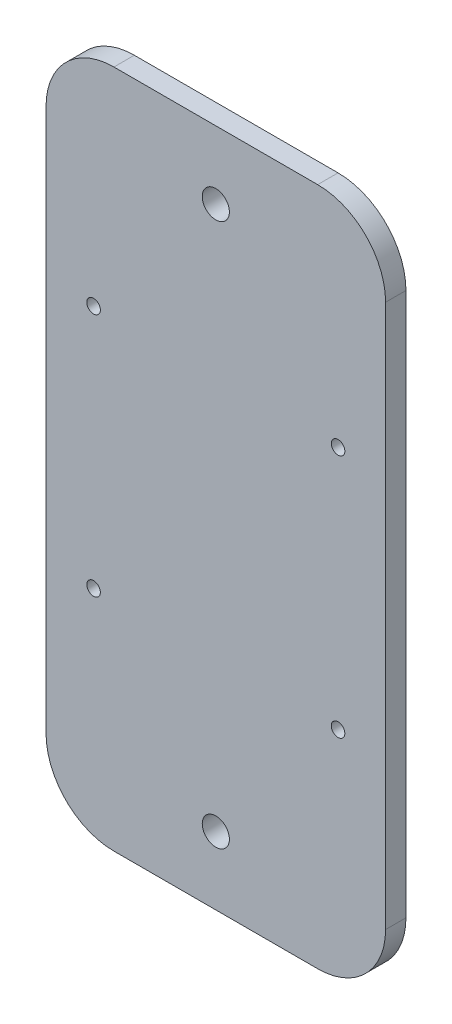
ISO-10303-21;
HEADER;
FILE_DESCRIPTION(('STEP AP214'),'2;1');
FILE_NAME('part.step','',(''),(''),'','','');
FILE_SCHEMA(('AUTOMOTIVE_DESIGN { 1 0 10303 214 1 1 1 1 }'));
ENDSEC;
DATA;
#1=APPLICATION_CONTEXT('core data for automotive mechanical design processes');
#2=APPLICATION_PROTOCOL_DEFINITION('international standard','automotive_design',2000,#1);
#3=PRODUCT_CONTEXT('',#1,'mechanical');
#4=PRODUCT('Part','Part','',(#3));
#5=PRODUCT_RELATED_PRODUCT_CATEGORY('part','',(#4));
#6=PRODUCT_DEFINITION_FORMATION('','',#4);
#7=PRODUCT_DEFINITION_CONTEXT('part definition',#1,'design');
#8=PRODUCT_DEFINITION('design','',#6,#7);
#9=PRODUCT_DEFINITION_SHAPE('','',#8);
#10=(LENGTH_UNIT() NAMED_UNIT(*) SI_UNIT(.MILLI.,.METRE.));
#11=(NAMED_UNIT(*) PLANE_ANGLE_UNIT() SI_UNIT($,.RADIAN.));
#12=(NAMED_UNIT(*) SI_UNIT($,.STERADIAN.) SOLID_ANGLE_UNIT());
#13=UNCERTAINTY_MEASURE_WITH_UNIT(LENGTH_MEASURE(1.E-05),#10,'distance_accuracy_value','');
#14=(GEOMETRIC_REPRESENTATION_CONTEXT(3) GLOBAL_UNCERTAINTY_ASSIGNED_CONTEXT((#13)) GLOBAL_UNIT_ASSIGNED_CONTEXT((#10,
#11,#12)) REPRESENTATION_CONTEXT('',''));
#15=CARTESIAN_POINT('',(0.,0.,0.));
#16=DIRECTION('',(0.,0.,1.));
#17=DIRECTION('',(1.,0.,0.));
#18=AXIS2_PLACEMENT_3D('',#15,#16,#17);
#19=CARTESIAN_POINT('',(-180.633802816901,158.529929577465,6.));
#20=DIRECTION('',(1.,0.,0.));
#21=DIRECTION('',(0.,1.,0.));
#22=AXIS2_PLACEMENT_3D('',#19,#20,#21);
#23=PLANE('',#22);
#24=DIRECTION('',(0.,-1.,0.));
#25=VECTOR('',#24,1.);
#26=CARTESIAN_POINT('',(-180.633802816901,158.529929577465,0.));
#27=LINE('',#26,#25);
#28=CARTESIAN_POINT('',(-180.633802816901,138.529929577465,0.));
#29=VERTEX_POINT('',#28);
#30=CARTESIAN_POINT('',(-180.633802816901,-21.4700704225352,0.));
#31=VERTEX_POINT('',#30);
#32=EDGE_CURVE('E134',#29,#31,#27,.T.);
#33=ORIENTED_EDGE('',*,*,#32,.T.);
#34=DIRECTION('',(0.,0.,-1.));
#35=VECTOR('',#34,1.);
#36=CARTESIAN_POINT('',(-180.633802816901,-21.4700704225352,6.));
#37=LINE('',#36,#35);
#38=CARTESIAN_POINT('',(-180.633802816901,-21.4700704225352,6.));
#39=VERTEX_POINT('',#38);
#40=EDGE_CURVE('E112',#31,#39,#37,.F.);
#41=ORIENTED_EDGE('',*,*,#40,.T.);
#42=DIRECTION('',(0.,-1.,0.));
#43=VECTOR('',#42,1.);
#44=CARTESIAN_POINT('',(-180.633802816901,158.529929577465,6.));
#45=LINE('',#44,#43);
#46=CARTESIAN_POINT('',(-180.633802816901,138.529929577465,6.));
#47=VERTEX_POINT('',#46);
#48=EDGE_CURVE('E144',#47,#39,#45,.T.);
#49=ORIENTED_EDGE('',*,*,#48,.F.);
#50=DIRECTION('',(0.,0.,-1.));
#51=VECTOR('',#50,1.);
#52=CARTESIAN_POINT('',(-180.633802816901,138.529929577465,6.));
#53=LINE('',#52,#51);
#54=EDGE_CURVE('E117',#47,#29,#53,.T.);
#55=ORIENTED_EDGE('',*,*,#54,.T.);
#56=EDGE_LOOP('',(#33,#41,#49,#55));
#57=FACE_BOUND('',#56,.T.);
#58=ADVANCED_FACE('F41',(#57),#23,.F.);
#59=CARTESIAN_POINT('',(-180.633802816901,-41.4700704225352,6.));
#60=DIRECTION('',(0.,1.,0.));
#61=DIRECTION('',(0.,0.,1.));
#62=AXIS2_PLACEMENT_3D('',#59,#60,#61);
#63=PLANE('',#62);
#64=DIRECTION('',(1.,0.,0.));
#65=VECTOR('',#64,1.);
#66=CARTESIAN_POINT('',(-180.633802816901,-41.4700704225352,6.));
#67=LINE('',#66,#65);
#68=CARTESIAN_POINT('',(-160.633802816901,-41.4700704225352,6.));
#69=VERTEX_POINT('',#68);
#70=CARTESIAN_POINT('',(-100.633802816901,-41.4700704225352,6.));
#71=VERTEX_POINT('',#70);
#72=EDGE_CURVE('E127',#69,#71,#67,.T.);
#73=ORIENTED_EDGE('',*,*,#72,.F.);
#74=DIRECTION('',(0.,0.,-1.));
#75=VECTOR('',#74,1.);
#76=CARTESIAN_POINT('',(-160.633802816901,-41.4700704225352,6.));
#77=LINE('',#76,#75);
#78=CARTESIAN_POINT('',(-160.633802816901,-41.4700704225352,0.));
#79=VERTEX_POINT('',#78);
#80=EDGE_CURVE('E111',#69,#79,#77,.T.);
#81=ORIENTED_EDGE('',*,*,#80,.T.);
#82=DIRECTION('',(1.,0.,0.));
#83=VECTOR('',#82,1.);
#84=CARTESIAN_POINT('',(-180.633802816901,-41.4700704225352,0.));
#85=LINE('',#84,#83);
#86=CARTESIAN_POINT('',(-100.633802816901,-41.4700704225352,0.));
#87=VERTEX_POINT('',#86);
#88=EDGE_CURVE('E124',#79,#87,#85,.T.);
#89=ORIENTED_EDGE('',*,*,#88,.T.);
#90=DIRECTION('',(0.,0.,-1.));
#91=VECTOR('',#90,1.);
#92=CARTESIAN_POINT('',(-100.633802816901,-41.4700704225352,6.));
#93=LINE('',#92,#91);
#94=EDGE_CURVE('E129',#87,#71,#93,.F.);
#95=ORIENTED_EDGE('',*,*,#94,.T.);
#96=EDGE_LOOP('',(#73,#81,#89,#95));
#97=FACE_BOUND('',#96,.T.);
#98=ADVANCED_FACE('F123',(#97),#63,.F.);
#99=CARTESIAN_POINT('',(-80.6338028169014,158.529929577465,6.));
#100=DIRECTION('',(-1.,0.,0.));
#101=DIRECTION('',(0.,-1.,0.));
#102=AXIS2_PLACEMENT_3D('',#99,#100,#101);
#103=PLANE('',#102);
#104=DIRECTION('',(0.,1.,0.));
#105=VECTOR('',#104,1.);
#106=CARTESIAN_POINT('',(-80.6338028169014,158.529929577465,6.));
#107=LINE('',#106,#105);
#108=CARTESIAN_POINT('',(-80.6338028169013,-21.4700704225352,6.));
#109=VERTEX_POINT('',#108);
#110=CARTESIAN_POINT('',(-80.6338028169014,138.529929577465,6.));
#111=VERTEX_POINT('',#110);
#112=EDGE_CURVE('E170',#109,#111,#107,.T.);
#113=ORIENTED_EDGE('',*,*,#112,.F.);
#114=DIRECTION('',(0.,0.,-1.));
#115=VECTOR('',#114,1.);
#116=CARTESIAN_POINT('',(-80.6338028169013,-21.4700704225352,6.));
#117=LINE('',#116,#115);
#118=CARTESIAN_POINT('',(-80.6338028169013,-21.4700704225352,0.));
#119=VERTEX_POINT('',#118);
#120=EDGE_CURVE('E163',#109,#119,#117,.T.);
#121=ORIENTED_EDGE('',*,*,#120,.T.);
#122=DIRECTION('',(0.,1.,0.));
#123=VECTOR('',#122,1.);
#124=CARTESIAN_POINT('',(-80.6338028169014,158.529929577465,0.));
#125=LINE('',#124,#123);
#126=CARTESIAN_POINT('',(-80.6338028169014,138.529929577465,0.));
#127=VERTEX_POINT('',#126);
#128=EDGE_CURVE('E133',#119,#127,#125,.T.);
#129=ORIENTED_EDGE('',*,*,#128,.T.);
#130=DIRECTION('',(0.,0.,-1.));
#131=VECTOR('',#130,1.);
#132=CARTESIAN_POINT('',(-80.6338028169014,138.529929577465,6.));
#133=LINE('',#132,#131);
#134=EDGE_CURVE('E161',#127,#111,#133,.F.);
#135=ORIENTED_EDGE('',*,*,#134,.T.);
#136=EDGE_LOOP('',(#113,#121,#129,#135));
#137=FACE_BOUND('',#136,.T.);
#138=ADVANCED_FACE('F168',(#137),#103,.F.);
#139=CARTESIAN_POINT('',(-180.633802816901,158.529929577465,6.));
#140=DIRECTION('',(0.,-1.,0.));
#141=DIRECTION('',(0.,0.,-1.));
#142=AXIS2_PLACEMENT_3D('',#139,#140,#141);
#143=PLANE('',#142);
#144=DIRECTION('',(-1.,0.,0.));
#145=VECTOR('',#144,1.);
#146=CARTESIAN_POINT('',(-180.633802816901,158.529929577465,6.));
#147=LINE('',#146,#145);
#148=CARTESIAN_POINT('',(-100.633802816901,158.529929577465,6.));
#149=VERTEX_POINT('',#148);
#150=CARTESIAN_POINT('',(-160.633802816901,158.529929577465,6.));
#151=VERTEX_POINT('',#150);
#152=EDGE_CURVE('E145',#149,#151,#147,.T.);
#153=ORIENTED_EDGE('',*,*,#152,.F.);
#154=DIRECTION('',(0.,0.,-1.));
#155=VECTOR('',#154,1.);
#156=CARTESIAN_POINT('',(-100.633802816901,158.529929577465,6.));
#157=LINE('',#156,#155);
#158=CARTESIAN_POINT('',(-100.633802816901,158.529929577465,0.));
#159=VERTEX_POINT('',#158);
#160=EDGE_CURVE('E11',#149,#159,#157,.T.);
#161=ORIENTED_EDGE('',*,*,#160,.T.);
#162=DIRECTION('',(-1.,0.,0.));
#163=VECTOR('',#162,1.);
#164=CARTESIAN_POINT('',(-180.633802816901,158.529929577465,0.));
#165=LINE('',#164,#163);
#166=CARTESIAN_POINT('',(-160.633802816901,158.529929577465,0.));
#167=VERTEX_POINT('',#166);
#168=EDGE_CURVE('E137',#159,#167,#165,.T.);
#169=ORIENTED_EDGE('',*,*,#168,.T.);
#170=DIRECTION('',(0.,0.,-1.));
#171=VECTOR('',#170,1.);
#172=CARTESIAN_POINT('',(-160.633802816901,158.529929577465,6.));
#173=LINE('',#172,#171);
#174=EDGE_CURVE('E49',#167,#151,#173,.F.);
#175=ORIENTED_EDGE('',*,*,#174,.T.);
#176=EDGE_LOOP('',(#153,#161,#169,#175));
#177=FACE_BOUND('',#176,.T.);
#178=ADVANCED_FACE('F177',(#177),#143,.F.);
#179=CARTESIAN_POINT('',(0.,0.,6.));
#180=DIRECTION('',(0.,0.,1.));
#181=DIRECTION('',(1.,0.,0.));
#182=AXIS2_PLACEMENT_3D('',#179,#180,#181);
#183=PLANE('',#182);
#184=CARTESIAN_POINT('',(-130.633802816901,-21.4700704225353,6.));
#185=DIRECTION('',(0.,0.,1.));
#186=DIRECTION('',(-1.,0.,0.));
#187=AXIS2_PLACEMENT_3D('',#184,#185,#186);
#188=CIRCLE('',#187,3.99999999999999);
#189=CARTESIAN_POINT('',(-134.633802816901,-21.4700704225353,6.));
#190=VERTEX_POINT('',#189);
#191=EDGE_CURVE('E190',#190,#190,#188,.T.);
#192=ORIENTED_EDGE('',*,*,#191,.F.);
#193=EDGE_LOOP('',(#192));
#194=FACE_BOUND('',#193,.T.);
#195=CARTESIAN_POINT('',(-130.633802816901,138.529929577465,6.));
#196=DIRECTION('',(0.,0.,1.));
#197=DIRECTION('',(1.,0.,0.));
#198=AXIS2_PLACEMENT_3D('',#195,#196,#197);
#199=CIRCLE('',#198,3.99999999999999);
#200=CARTESIAN_POINT('',(-126.633802816901,138.529929577465,6.));
#201=VERTEX_POINT('',#200);
#202=EDGE_CURVE('E197',#201,#201,#199,.T.);
#203=ORIENTED_EDGE('',*,*,#202,.F.);
#204=EDGE_LOOP('',(#203));
#205=FACE_BOUND('',#204,.T.);
#206=CARTESIAN_POINT('',(-94.6338028169013,94.5299295774648,6.));
#207=DIRECTION('',(0.,0.,1.));
#208=DIRECTION('',(-1.,0.,0.));
#209=AXIS2_PLACEMENT_3D('',#206,#207,#208);
#210=CIRCLE('',#209,2.);
#211=CARTESIAN_POINT('',(-96.6338028169013,94.5299295774648,6.));
#212=VERTEX_POINT('',#211);
#213=EDGE_CURVE('E203',#212,#212,#210,.T.);
#214=ORIENTED_EDGE('',*,*,#213,.F.);
#215=EDGE_LOOP('',(#214));
#216=FACE_BOUND('',#215,.T.);
#217=CARTESIAN_POINT('',(-94.6338028169013,22.5299295774648,6.));
#218=DIRECTION('',(0.,0.,1.));
#219=DIRECTION('',(1.,0.,0.));
#220=AXIS2_PLACEMENT_3D('',#217,#218,#219);
#221=CIRCLE('',#220,2.);
#222=CARTESIAN_POINT('',(-92.6338028169013,22.5299295774648,6.));
#223=VERTEX_POINT('',#222);
#224=EDGE_CURVE('E209',#223,#223,#221,.T.);
#225=ORIENTED_EDGE('',*,*,#224,.F.);
#226=EDGE_LOOP('',(#225));
#227=FACE_BOUND('',#226,.T.);
#228=CARTESIAN_POINT('',(-166.633802816901,22.5299295774648,6.));
#229=DIRECTION('',(0.,0.,1.));
#230=DIRECTION('',(-1.,0.,0.));
#231=AXIS2_PLACEMENT_3D('',#228,#229,#230);
#232=CIRCLE('',#231,2.);
#233=CARTESIAN_POINT('',(-168.633802816901,22.5299295774648,6.));
#234=VERTEX_POINT('',#233);
#235=EDGE_CURVE('E189',#234,#234,#232,.T.);
#236=ORIENTED_EDGE('',*,*,#235,.F.);
#237=EDGE_LOOP('',(#236));
#238=FACE_BOUND('',#237,.T.);
#239=CARTESIAN_POINT('',(-166.633802816901,94.5299295774648,6.));
#240=DIRECTION('',(0.,0.,1.));
#241=DIRECTION('',(1.,0.,0.));
#242=AXIS2_PLACEMENT_3D('',#239,#240,#241);
#243=CIRCLE('',#242,2.);
#244=CARTESIAN_POINT('',(-164.633802816901,94.5299295774648,6.));
#245=VERTEX_POINT('',#244);
#246=EDGE_CURVE('E186',#245,#245,#243,.T.);
#247=ORIENTED_EDGE('',*,*,#246,.F.);
#248=EDGE_LOOP('',(#247));
#249=FACE_BOUND('',#248,.T.);
#250=ORIENTED_EDGE('',*,*,#48,.T.);
#251=CARTESIAN_POINT('',(-160.633802816901,-21.4700704225352,6.));
#252=DIRECTION('',(0.,0.,1.));
#253=DIRECTION('',(1.,0.,0.));
#254=AXIS2_PLACEMENT_3D('',#251,#252,#253);
#255=CIRCLE('',#254,20.);
#256=EDGE_CURVE('E159',#39,#69,#255,.T.);
#257=ORIENTED_EDGE('',*,*,#256,.T.);
#258=ORIENTED_EDGE('',*,*,#72,.T.);
#259=CARTESIAN_POINT('',(-100.633802816901,-21.4700704225352,6.));
#260=DIRECTION('',(0.,0.,1.));
#261=DIRECTION('',(1.,0.,0.));
#262=AXIS2_PLACEMENT_3D('',#259,#260,#261);
#263=CIRCLE('',#262,20.);
#264=EDGE_CURVE('E157',#71,#109,#263,.T.);
#265=ORIENTED_EDGE('',*,*,#264,.T.);
#266=ORIENTED_EDGE('',*,*,#112,.T.);
#267=CARTESIAN_POINT('',(-100.633802816901,138.529929577465,6.));
#268=DIRECTION('',(0.,0.,1.));
#269=DIRECTION('',(1.,0.,0.));
#270=AXIS2_PLACEMENT_3D('',#267,#268,#269);
#271=CIRCLE('',#270,20.);
#272=EDGE_CURVE('E62',#111,#149,#271,.T.);
#273=ORIENTED_EDGE('',*,*,#272,.T.);
#274=ORIENTED_EDGE('',*,*,#152,.T.);
#275=CARTESIAN_POINT('',(-160.633802816901,138.529929577465,6.));
#276=DIRECTION('',(0.,0.,1.));
#277=DIRECTION('',(1.,0.,0.));
#278=AXIS2_PLACEMENT_3D('',#275,#276,#277);
#279=CIRCLE('',#278,20.);
#280=EDGE_CURVE('E154',#151,#47,#279,.T.);
#281=ORIENTED_EDGE('',*,*,#280,.T.);
#282=EDGE_LOOP('',(#250,#257,#258,#265,#266,#273,#274,#281));
#283=FACE_BOUND('',#282,.T.);
#284=ADVANCED_FACE('F226',(#194,#205,#216,#227,#238,#249,#283),#183,.T.);
#285=CARTESIAN_POINT('',(0.,0.,0.));
#286=DIRECTION('',(0.,0.,1.));
#287=DIRECTION('',(1.,0.,0.));
#288=AXIS2_PLACEMENT_3D('',#285,#286,#287);
#289=PLANE('',#288);
#290=CARTESIAN_POINT('',(-130.633802816901,-21.4700704225353,0.));
#291=DIRECTION('',(0.,0.,1.));
#292=DIRECTION('',(1.,0.,0.));
#293=AXIS2_PLACEMENT_3D('',#290,#291,#292);
#294=CIRCLE('',#293,3.99999999999999);
#295=CARTESIAN_POINT('',(-126.633802816901,-21.4700704225353,0.));
#296=VERTEX_POINT('',#295);
#297=EDGE_CURVE('E194',#296,#296,#294,.F.);
#298=ORIENTED_EDGE('',*,*,#297,.F.);
#299=EDGE_LOOP('',(#298));
#300=FACE_BOUND('',#299,.T.);
#301=CARTESIAN_POINT('',(-130.633802816901,138.529929577465,0.));
#302=DIRECTION('',(0.,0.,1.));
#303=DIRECTION('',(1.,0.,0.));
#304=AXIS2_PLACEMENT_3D('',#301,#302,#303);
#305=CIRCLE('',#304,3.99999999999999);
#306=CARTESIAN_POINT('',(-126.633802816901,138.529929577465,0.));
#307=VERTEX_POINT('',#306);
#308=EDGE_CURVE('E193',#307,#307,#305,.F.);
#309=ORIENTED_EDGE('',*,*,#308,.F.);
#310=EDGE_LOOP('',(#309));
#311=FACE_BOUND('',#310,.T.);
#312=CARTESIAN_POINT('',(-94.6338028169013,94.5299295774648,0.));
#313=DIRECTION('',(0.,0.,1.));
#314=DIRECTION('',(1.,0.,0.));
#315=AXIS2_PLACEMENT_3D('',#312,#313,#314);
#316=CIRCLE('',#315,2.);
#317=CARTESIAN_POINT('',(-92.6338028169013,94.5299295774648,0.));
#318=VERTEX_POINT('',#317);
#319=EDGE_CURVE('E200',#318,#318,#316,.F.);
#320=ORIENTED_EDGE('',*,*,#319,.F.);
#321=EDGE_LOOP('',(#320));
#322=FACE_BOUND('',#321,.T.);
#323=CARTESIAN_POINT('',(-94.6338028169013,22.5299295774648,0.));
#324=DIRECTION('',(0.,0.,1.));
#325=DIRECTION('',(1.,0.,0.));
#326=AXIS2_PLACEMENT_3D('',#323,#324,#325);
#327=CIRCLE('',#326,2.);
#328=CARTESIAN_POINT('',(-92.6338028169013,22.5299295774648,0.));
#329=VERTEX_POINT('',#328);
#330=EDGE_CURVE('E206',#329,#329,#327,.F.);
#331=ORIENTED_EDGE('',*,*,#330,.F.);
#332=EDGE_LOOP('',(#331));
#333=FACE_BOUND('',#332,.T.);
#334=CARTESIAN_POINT('',(-166.633802816901,22.5299295774648,0.));
#335=DIRECTION('',(0.,0.,1.));
#336=DIRECTION('',(1.,0.,0.));
#337=AXIS2_PLACEMENT_3D('',#334,#335,#336);
#338=CIRCLE('',#337,2.);
#339=CARTESIAN_POINT('',(-164.633802816901,22.5299295774648,0.));
#340=VERTEX_POINT('',#339);
#341=EDGE_CURVE('E212',#340,#340,#338,.F.);
#342=ORIENTED_EDGE('',*,*,#341,.F.);
#343=EDGE_LOOP('',(#342));
#344=FACE_BOUND('',#343,.T.);
#345=CARTESIAN_POINT('',(-166.633802816901,94.5299295774648,0.));
#346=DIRECTION('',(0.,0.,1.));
#347=DIRECTION('',(1.,0.,0.));
#348=AXIS2_PLACEMENT_3D('',#345,#346,#347);
#349=CIRCLE('',#348,2.);
#350=CARTESIAN_POINT('',(-164.633802816901,94.5299295774648,0.));
#351=VERTEX_POINT('',#350);
#352=EDGE_CURVE('E139',#351,#351,#349,.F.);
#353=ORIENTED_EDGE('',*,*,#352,.F.);
#354=EDGE_LOOP('',(#353));
#355=FACE_BOUND('',#354,.T.);
#356=ORIENTED_EDGE('',*,*,#88,.F.);
#357=CARTESIAN_POINT('',(-160.633802816901,-21.4700704225352,0.));
#358=DIRECTION('',(0.,0.,1.));
#359=DIRECTION('',(1.,0.,0.));
#360=AXIS2_PLACEMENT_3D('',#357,#358,#359);
#361=CIRCLE('',#360,20.);
#362=EDGE_CURVE('E107',#79,#31,#361,.F.);
#363=ORIENTED_EDGE('',*,*,#362,.T.);
#364=ORIENTED_EDGE('',*,*,#32,.F.);
#365=CARTESIAN_POINT('',(-160.633802816901,138.529929577465,0.));
#366=DIRECTION('',(0.,0.,1.));
#367=DIRECTION('',(1.,0.,0.));
#368=AXIS2_PLACEMENT_3D('',#365,#366,#367);
#369=CIRCLE('',#368,20.);
#370=EDGE_CURVE('E128',#29,#167,#369,.F.);
#371=ORIENTED_EDGE('',*,*,#370,.T.);
#372=ORIENTED_EDGE('',*,*,#168,.F.);
#373=CARTESIAN_POINT('',(-100.633802816901,138.529929577465,0.));
#374=DIRECTION('',(0.,0.,1.));
#375=DIRECTION('',(1.,0.,0.));
#376=AXIS2_PLACEMENT_3D('',#373,#374,#375);
#377=CIRCLE('',#376,20.);
#378=EDGE_CURVE('E148',#159,#127,#377,.F.);
#379=ORIENTED_EDGE('',*,*,#378,.T.);
#380=ORIENTED_EDGE('',*,*,#128,.F.);
#381=CARTESIAN_POINT('',(-100.633802816901,-21.4700704225352,0.));
#382=DIRECTION('',(0.,0.,1.));
#383=DIRECTION('',(1.,0.,0.));
#384=AXIS2_PLACEMENT_3D('',#381,#382,#383);
#385=CIRCLE('',#384,20.);
#386=EDGE_CURVE('E118',#119,#87,#385,.F.);
#387=ORIENTED_EDGE('',*,*,#386,.T.);
#388=EDGE_LOOP('',(#356,#363,#364,#371,#372,#379,#380,#387));
#389=FACE_BOUND('',#388,.T.);
#390=ADVANCED_FACE('F131',(#300,#311,#322,#333,#344,#355,#389),#289,.F.);
#391=CARTESIAN_POINT('',(-166.633802816901,94.5299295774648,-11.3137084989848));
#392=DIRECTION('',(0.,0.,1.));
#393=DIRECTION('',(1.,0.,0.));
#394=AXIS2_PLACEMENT_3D('',#391,#392,#393);
#395=CYLINDRICAL_SURFACE('',#394,2.);
#396=ORIENTED_EDGE('',*,*,#352,.T.);
#397=EDGE_LOOP('',(#396));
#398=FACE_BOUND('',#397,.T.);
#399=ORIENTED_EDGE('',*,*,#246,.T.);
#400=EDGE_LOOP('',(#399));
#401=FACE_BOUND('',#400,.T.);
#402=ADVANCED_FACE('F225',(#398,#401),#395,.F.);
#403=CARTESIAN_POINT('',(-166.633802816901,22.5299295774648,-11.3137084989848));
#404=DIRECTION('',(0.,0.,1.));
#405=DIRECTION('',(1.,0.,0.));
#406=AXIS2_PLACEMENT_3D('',#403,#404,#405);
#407=CYLINDRICAL_SURFACE('',#406,2.);
#408=ORIENTED_EDGE('',*,*,#341,.T.);
#409=EDGE_LOOP('',(#408));
#410=FACE_BOUND('',#409,.T.);
#411=ORIENTED_EDGE('',*,*,#235,.T.);
#412=EDGE_LOOP('',(#411));
#413=FACE_BOUND('',#412,.T.);
#414=ADVANCED_FACE('F220',(#410,#413),#407,.F.);
#415=CARTESIAN_POINT('',(-94.6338028169013,22.5299295774648,-11.3137084989848));
#416=DIRECTION('',(0.,0.,1.));
#417=DIRECTION('',(1.,0.,0.));
#418=AXIS2_PLACEMENT_3D('',#415,#416,#417);
#419=CYLINDRICAL_SURFACE('',#418,2.);
#420=ORIENTED_EDGE('',*,*,#330,.T.);
#421=EDGE_LOOP('',(#420));
#422=FACE_BOUND('',#421,.T.);
#423=ORIENTED_EDGE('',*,*,#224,.T.);
#424=EDGE_LOOP('',(#423));
#425=FACE_BOUND('',#424,.T.);
#426=ADVANCED_FACE('F305',(#422,#425),#419,.F.);
#427=CARTESIAN_POINT('',(-94.6338028169013,94.5299295774648,-11.3137084989848));
#428=DIRECTION('',(0.,0.,1.));
#429=DIRECTION('',(1.,0.,0.));
#430=AXIS2_PLACEMENT_3D('',#427,#428,#429);
#431=CYLINDRICAL_SURFACE('',#430,2.);
#432=ORIENTED_EDGE('',*,*,#319,.T.);
#433=EDGE_LOOP('',(#432));
#434=FACE_BOUND('',#433,.T.);
#435=ORIENTED_EDGE('',*,*,#213,.T.);
#436=EDGE_LOOP('',(#435));
#437=FACE_BOUND('',#436,.T.);
#438=ADVANCED_FACE('F296',(#434,#437),#431,.F.);
#439=CARTESIAN_POINT('',(-130.633802816901,138.529929577465,-11.3137084989848));
#440=DIRECTION('',(0.,0.,1.));
#441=DIRECTION('',(1.,0.,0.));
#442=AXIS2_PLACEMENT_3D('',#439,#440,#441);
#443=CYLINDRICAL_SURFACE('',#442,3.99999999999999);
#444=ORIENTED_EDGE('',*,*,#308,.T.);
#445=EDGE_LOOP('',(#444));
#446=FACE_BOUND('',#445,.T.);
#447=ORIENTED_EDGE('',*,*,#202,.T.);
#448=EDGE_LOOP('',(#447));
#449=FACE_BOUND('',#448,.T.);
#450=ADVANCED_FACE('F287',(#446,#449),#443,.F.);
#451=CARTESIAN_POINT('',(-130.633802816901,-21.4700704225353,-11.3137084989848));
#452=DIRECTION('',(0.,0.,1.));
#453=DIRECTION('',(1.,0.,0.));
#454=AXIS2_PLACEMENT_3D('',#451,#452,#453);
#455=CYLINDRICAL_SURFACE('',#454,3.99999999999999);
#456=ORIENTED_EDGE('',*,*,#297,.T.);
#457=EDGE_LOOP('',(#456));
#458=FACE_BOUND('',#457,.T.);
#459=ORIENTED_EDGE('',*,*,#191,.T.);
#460=EDGE_LOOP('',(#459));
#461=FACE_BOUND('',#460,.T.);
#462=ADVANCED_FACE('F259',(#458,#461),#455,.F.);
#463=CARTESIAN_POINT('',(-160.633802816901,-21.4700704225352,6.));
#464=DIRECTION('',(0.,0.,-1.));
#465=DIRECTION('',(-1.,0.,0.));
#466=AXIS2_PLACEMENT_3D('',#463,#464,#465);
#467=CYLINDRICAL_SURFACE('',#466,20.);
#468=ORIENTED_EDGE('',*,*,#256,.F.);
#469=ORIENTED_EDGE('',*,*,#40,.F.);
#470=ORIENTED_EDGE('',*,*,#362,.F.);
#471=ORIENTED_EDGE('',*,*,#80,.F.);
#472=EDGE_LOOP('',(#468,#469,#470,#471));
#473=FACE_BOUND('',#472,.T.);
#474=ADVANCED_FACE('F110',(#473),#467,.T.);
#475=CARTESIAN_POINT('',(-100.633802816901,-21.4700704225352,6.));
#476=DIRECTION('',(0.,0.,-1.));
#477=DIRECTION('',(-1.,0.,0.));
#478=AXIS2_PLACEMENT_3D('',#475,#476,#477);
#479=CYLINDRICAL_SURFACE('',#478,20.);
#480=ORIENTED_EDGE('',*,*,#264,.F.);
#481=ORIENTED_EDGE('',*,*,#94,.F.);
#482=ORIENTED_EDGE('',*,*,#386,.F.);
#483=ORIENTED_EDGE('',*,*,#120,.F.);
#484=EDGE_LOOP('',(#480,#481,#482,#483));
#485=FACE_BOUND('',#484,.T.);
#486=ADVANCED_FACE('F247',(#485),#479,.T.);
#487=CARTESIAN_POINT('',(-100.633802816901,138.529929577465,6.));
#488=DIRECTION('',(0.,0.,-1.));
#489=DIRECTION('',(-1.,0.,0.));
#490=AXIS2_PLACEMENT_3D('',#487,#488,#489);
#491=CYLINDRICAL_SURFACE('',#490,20.);
#492=ORIENTED_EDGE('',*,*,#272,.F.);
#493=ORIENTED_EDGE('',*,*,#134,.F.);
#494=ORIENTED_EDGE('',*,*,#378,.F.);
#495=ORIENTED_EDGE('',*,*,#160,.F.);
#496=EDGE_LOOP('',(#492,#493,#494,#495));
#497=FACE_BOUND('',#496,.T.);
#498=ADVANCED_FACE('F176',(#497),#491,.T.);
#499=CARTESIAN_POINT('',(-160.633802816901,138.529929577465,6.));
#500=DIRECTION('',(0.,0.,-1.));
#501=DIRECTION('',(-1.,0.,0.));
#502=AXIS2_PLACEMENT_3D('',#499,#500,#501);
#503=CYLINDRICAL_SURFACE('',#502,20.);
#504=ORIENTED_EDGE('',*,*,#280,.F.);
#505=ORIENTED_EDGE('',*,*,#174,.F.);
#506=ORIENTED_EDGE('',*,*,#370,.F.);
#507=ORIENTED_EDGE('',*,*,#54,.F.);
#508=EDGE_LOOP('',(#504,#505,#506,#507));
#509=FACE_BOUND('',#508,.T.);
#510=ADVANCED_FACE('F43',(#509),#503,.T.);
#511=CLOSED_SHELL('',(#58,#98,#138,#178,#284,#390,#402,#414,#426,#438,#450,#462,#474,#486,#498,#510));
#512=MANIFOLD_SOLID_BREP('B2',#511);
#513=ADVANCED_BREP_SHAPE_REPRESENTATION('',(#18,#512),#14);
#514=SHAPE_DEFINITION_REPRESENTATION(#9,#513);
ENDSEC;
END-ISO-10303-21;
